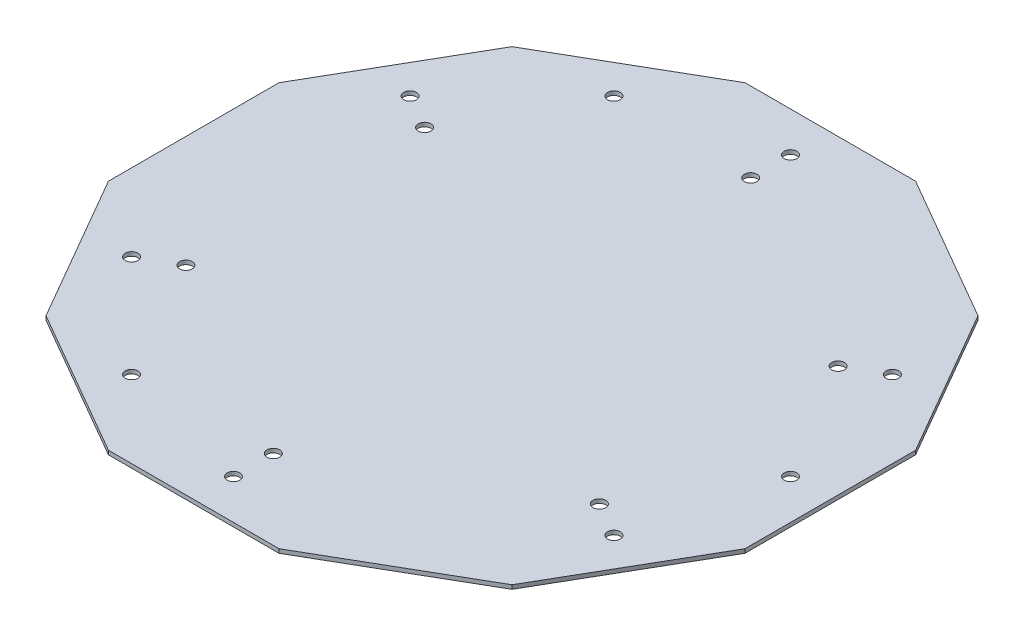
ISO-10303-21;
HEADER;
FILE_DESCRIPTION(('STEP AP214'),'2;1');
FILE_NAME('part.step','',(''),(''),'','','');
FILE_SCHEMA(('AUTOMOTIVE_DESIGN { 1 0 10303 214 1 1 1 1 }'));
ENDSEC;
DATA;
#1=APPLICATION_CONTEXT('core data for automotive mechanical design processes');
#2=APPLICATION_PROTOCOL_DEFINITION('international standard','automotive_design',2000,#1);
#3=PRODUCT_CONTEXT('',#1,'mechanical');
#4=PRODUCT('Part','Part','',(#3));
#5=PRODUCT_RELATED_PRODUCT_CATEGORY('part','',(#4));
#6=PRODUCT_DEFINITION_FORMATION('','',#4);
#7=PRODUCT_DEFINITION_CONTEXT('part definition',#1,'design');
#8=PRODUCT_DEFINITION('design','',#6,#7);
#9=PRODUCT_DEFINITION_SHAPE('','',#8);
#10=(LENGTH_UNIT() NAMED_UNIT(*) SI_UNIT(.MILLI.,.METRE.));
#11=(NAMED_UNIT(*) PLANE_ANGLE_UNIT() SI_UNIT($,.RADIAN.));
#12=(NAMED_UNIT(*) SI_UNIT($,.STERADIAN.) SOLID_ANGLE_UNIT());
#13=UNCERTAINTY_MEASURE_WITH_UNIT(LENGTH_MEASURE(1.E-05),#10,'distance_accuracy_value','');
#14=(GEOMETRIC_REPRESENTATION_CONTEXT(3) GLOBAL_UNCERTAINTY_ASSIGNED_CONTEXT((#13)) GLOBAL_UNIT_ASSIGNED_CONTEXT((#10,
#11,#12)) REPRESENTATION_CONTEXT('',''));
#15=CARTESIAN_POINT('',(0.,0.,0.));
#16=DIRECTION('',(0.,0.,1.));
#17=DIRECTION('',(1.,0.,0.));
#18=AXIS2_PLACEMENT_3D('',#15,#16,#17);
#19=CARTESIAN_POINT('',(79.9999999999999,1.,21.4359353944897));
#20=DIRECTION('',(-1.,0.,0.));
#21=DIRECTION('',(0.,0.,1.));
#22=AXIS2_PLACEMENT_3D('',#19,#20,#21);
#23=PLANE('',#22);
#24=DIRECTION('',(0.,0.,-1.));
#25=VECTOR('',#24,1.);
#26=CARTESIAN_POINT('',(79.9999999999999,0.,21.4359353944897));
#27=LINE('',#26,#25);
#28=CARTESIAN_POINT('',(79.9999999999999,0.,21.4359353944897));
#29=VERTEX_POINT('',#28);
#30=CARTESIAN_POINT('',(79.9999999999999,0.,-21.4359353944899));
#31=VERTEX_POINT('',#30);
#32=EDGE_CURVE('E155',#29,#31,#27,.T.);
#33=ORIENTED_EDGE('',*,*,#32,.T.);
#34=DIRECTION('',(0.,-1.,0.));
#35=VECTOR('',#34,1.);
#36=CARTESIAN_POINT('',(79.9999999999999,1.,-21.4359353944899));
#37=LINE('',#36,#35);
#38=CARTESIAN_POINT('',(79.9999999999999,1.,-21.4359353944899));
#39=VERTEX_POINT('',#38);
#40=EDGE_CURVE('E11',#39,#31,#37,.T.);
#41=ORIENTED_EDGE('',*,*,#40,.F.);
#42=DIRECTION('',(0.,0.,-1.));
#43=VECTOR('',#42,1.);
#44=CARTESIAN_POINT('',(79.9999999999999,1.,21.4359353944897));
#45=LINE('',#44,#43);
#46=CARTESIAN_POINT('',(79.9999999999999,1.,21.4359353944897));
#47=VERTEX_POINT('',#46);
#48=EDGE_CURVE('E178',#47,#39,#45,.T.);
#49=ORIENTED_EDGE('',*,*,#48,.F.);
#50=DIRECTION('',(0.,-1.,0.));
#51=VECTOR('',#50,1.);
#52=CARTESIAN_POINT('',(79.9999999999999,1.,21.4359353944897));
#53=LINE('',#52,#51);
#54=EDGE_CURVE('E151',#47,#29,#53,.T.);
#55=ORIENTED_EDGE('',*,*,#54,.T.);
#56=EDGE_LOOP('',(#33,#41,#49,#55));
#57=FACE_BOUND('',#56,.T.);
#58=ADVANCED_FACE('F35',(#57),#23,.F.);
#59=CARTESIAN_POINT('',(79.9999999999999,1.,-21.4359353944899));
#60=DIRECTION('',(-0.866025403784438,0.,0.500000000000002));
#61=DIRECTION('',(0.500000000000002,0.,0.866025403784438));
#62=AXIS2_PLACEMENT_3D('',#59,#60,#61);
#63=PLANE('',#62);
#64=DIRECTION('',(-0.500000000000002,0.,-0.866025403784438));
#65=VECTOR('',#64,1.);
#66=CARTESIAN_POINT('',(79.9999999999999,0.,-21.4359353944899));
#67=LINE('',#66,#65);
#68=CARTESIAN_POINT('',(58.56406460551,0.,-58.5640646055102));
#69=VERTEX_POINT('',#68);
#70=EDGE_CURVE('E158',#31,#69,#67,.T.);
#71=ORIENTED_EDGE('',*,*,#70,.T.);
#72=DIRECTION('',(0.,-1.,0.));
#73=VECTOR('',#72,1.);
#74=CARTESIAN_POINT('',(58.56406460551,1.,-58.5640646055102));
#75=LINE('',#74,#73);
#76=CARTESIAN_POINT('',(58.56406460551,1.,-58.5640646055102));
#77=VERTEX_POINT('',#76);
#78=EDGE_CURVE('E43',#77,#69,#75,.T.);
#79=ORIENTED_EDGE('',*,*,#78,.F.);
#80=DIRECTION('',(-0.500000000000002,0.,-0.866025403784438));
#81=VECTOR('',#80,1.);
#82=CARTESIAN_POINT('',(79.9999999999999,1.,-21.4359353944899));
#83=LINE('',#82,#81);
#84=EDGE_CURVE('E106',#39,#77,#83,.T.);
#85=ORIENTED_EDGE('',*,*,#84,.F.);
#86=ORIENTED_EDGE('',*,*,#40,.T.);
#87=EDGE_LOOP('',(#71,#79,#85,#86));
#88=FACE_BOUND('',#87,.T.);
#89=ADVANCED_FACE('F257',(#88),#63,.F.);
#90=CARTESIAN_POINT('',(58.56406460551,1.,-58.5640646055102));
#91=DIRECTION('',(-0.499999999999999,0.,0.866025403784439));
#92=DIRECTION('',(0.866025403784439,0.,0.499999999999999));
#93=AXIS2_PLACEMENT_3D('',#90,#91,#92);
#94=PLANE('',#93);
#95=DIRECTION('',(-0.866025403784439,0.,-0.499999999999999));
#96=VECTOR('',#95,1.);
#97=CARTESIAN_POINT('',(58.56406460551,0.,-58.5640646055102));
#98=LINE('',#97,#96);
#99=CARTESIAN_POINT('',(21.4359353944897,0.,-79.9999999999999));
#100=VERTEX_POINT('',#99);
#101=EDGE_CURVE('E161',#69,#100,#98,.T.);
#102=ORIENTED_EDGE('',*,*,#101,.T.);
#103=DIRECTION('',(0.,-1.,0.));
#104=VECTOR('',#103,1.);
#105=CARTESIAN_POINT('',(21.4359353944897,1.,-79.9999999999999));
#106=LINE('',#105,#104);
#107=CARTESIAN_POINT('',(21.4359353944897,1.,-79.9999999999999));
#108=VERTEX_POINT('',#107);
#109=EDGE_CURVE('E197',#108,#100,#106,.T.);
#110=ORIENTED_EDGE('',*,*,#109,.F.);
#111=DIRECTION('',(-0.866025403784439,0.,-0.499999999999999));
#112=VECTOR('',#111,1.);
#113=CARTESIAN_POINT('',(58.56406460551,1.,-58.5640646055102));
#114=LINE('',#113,#112);
#115=EDGE_CURVE('E205',#77,#108,#114,.T.);
#116=ORIENTED_EDGE('',*,*,#115,.F.);
#117=ORIENTED_EDGE('',*,*,#78,.T.);
#118=EDGE_LOOP('',(#102,#110,#116,#117));
#119=FACE_BOUND('',#118,.T.);
#120=ADVANCED_FACE('F203',(#119),#94,.F.);
#121=CARTESIAN_POINT('',(21.4359353944897,1.,-79.9999999999999));
#122=DIRECTION('',(0.,0.,1.));
#123=DIRECTION('',(1.,0.,0.));
#124=AXIS2_PLACEMENT_3D('',#121,#122,#123);
#125=PLANE('',#124);
#126=DIRECTION('',(-1.,0.,0.));
#127=VECTOR('',#126,1.);
#128=CARTESIAN_POINT('',(21.4359353944897,0.,-79.9999999999999));
#129=LINE('',#128,#127);
#130=CARTESIAN_POINT('',(-21.4359353944899,0.,-79.9999999999999));
#131=VERTEX_POINT('',#130);
#132=EDGE_CURVE('E163',#100,#131,#129,.T.);
#133=ORIENTED_EDGE('',*,*,#132,.T.);
#134=DIRECTION('',(0.,-1.,0.));
#135=VECTOR('',#134,1.);
#136=CARTESIAN_POINT('',(-21.4359353944899,1.,-79.9999999999999));
#137=LINE('',#136,#135);
#138=CARTESIAN_POINT('',(-21.4359353944899,1.,-79.9999999999999));
#139=VERTEX_POINT('',#138);
#140=EDGE_CURVE('E194',#139,#131,#137,.T.);
#141=ORIENTED_EDGE('',*,*,#140,.F.);
#142=DIRECTION('',(-1.,0.,0.));
#143=VECTOR('',#142,1.);
#144=CARTESIAN_POINT('',(21.4359353944897,1.,-79.9999999999999));
#145=LINE('',#144,#143);
#146=EDGE_CURVE('E223',#108,#139,#145,.T.);
#147=ORIENTED_EDGE('',*,*,#146,.F.);
#148=ORIENTED_EDGE('',*,*,#109,.T.);
#149=EDGE_LOOP('',(#133,#141,#147,#148));
#150=FACE_BOUND('',#149,.T.);
#151=ADVANCED_FACE('F214',(#150),#125,.F.);
#152=CARTESIAN_POINT('',(-21.4359353944899,1.,-79.9999999999999));
#153=DIRECTION('',(0.500000000000001,0.,0.866025403784438));
#154=DIRECTION('',(0.866025403784438,0.,-0.500000000000001));
#155=AXIS2_PLACEMENT_3D('',#152,#153,#154);
#156=PLANE('',#155);
#157=DIRECTION('',(-0.866025403784438,0.,0.500000000000001));
#158=VECTOR('',#157,1.);
#159=CARTESIAN_POINT('',(-21.4359353944899,0.,-79.9999999999999));
#160=LINE('',#159,#158);
#161=CARTESIAN_POINT('',(-58.5640646055102,0.,-58.56406460551));
#162=VERTEX_POINT('',#161);
#163=EDGE_CURVE('E165',#131,#162,#160,.T.);
#164=ORIENTED_EDGE('',*,*,#163,.T.);
#165=DIRECTION('',(0.,-1.,0.));
#166=VECTOR('',#165,1.);
#167=CARTESIAN_POINT('',(-58.5640646055102,1.,-58.56406460551));
#168=LINE('',#167,#166);
#169=CARTESIAN_POINT('',(-58.5640646055102,1.,-58.56406460551));
#170=VERTEX_POINT('',#169);
#171=EDGE_CURVE('E191',#170,#162,#168,.T.);
#172=ORIENTED_EDGE('',*,*,#171,.F.);
#173=DIRECTION('',(-0.866025403784438,0.,0.500000000000001));
#174=VECTOR('',#173,1.);
#175=CARTESIAN_POINT('',(-21.4359353944899,1.,-79.9999999999999));
#176=LINE('',#175,#174);
#177=EDGE_CURVE('E220',#139,#170,#176,.T.);
#178=ORIENTED_EDGE('',*,*,#177,.F.);
#179=ORIENTED_EDGE('',*,*,#140,.T.);
#180=EDGE_LOOP('',(#164,#172,#178,#179));
#181=FACE_BOUND('',#180,.T.);
#182=ADVANCED_FACE('F218',(#181),#156,.F.);
#183=CARTESIAN_POINT('',(-58.5640646055102,1.,-58.56406460551));
#184=DIRECTION('',(0.866025403784439,0.,0.499999999999999));
#185=DIRECTION('',(0.499999999999999,0.,-0.866025403784439));
#186=AXIS2_PLACEMENT_3D('',#183,#184,#185);
#187=PLANE('',#186);
#188=DIRECTION('',(-0.499999999999999,0.,0.866025403784439));
#189=VECTOR('',#188,1.);
#190=CARTESIAN_POINT('',(-58.5640646055102,0.,-58.56406460551));
#191=LINE('',#190,#189);
#192=CARTESIAN_POINT('',(-79.9999999999999,0.,-21.4359353944897));
#193=VERTEX_POINT('',#192);
#194=EDGE_CURVE('E167',#162,#193,#191,.T.);
#195=ORIENTED_EDGE('',*,*,#194,.T.);
#196=DIRECTION('',(0.,-1.,0.));
#197=VECTOR('',#196,1.);
#198=CARTESIAN_POINT('',(-79.9999999999999,1.,-21.4359353944897));
#199=LINE('',#198,#197);
#200=CARTESIAN_POINT('',(-79.9999999999999,1.,-21.4359353944897));
#201=VERTEX_POINT('',#200);
#202=EDGE_CURVE('E188',#201,#193,#199,.T.);
#203=ORIENTED_EDGE('',*,*,#202,.F.);
#204=DIRECTION('',(-0.499999999999999,0.,0.866025403784439));
#205=VECTOR('',#204,1.);
#206=CARTESIAN_POINT('',(-58.5640646055102,1.,-58.56406460551));
#207=LINE('',#206,#205);
#208=EDGE_CURVE('E222',#170,#201,#207,.T.);
#209=ORIENTED_EDGE('',*,*,#208,.F.);
#210=ORIENTED_EDGE('',*,*,#171,.T.);
#211=EDGE_LOOP('',(#195,#203,#209,#210));
#212=FACE_BOUND('',#211,.T.);
#213=ADVANCED_FACE('F270',(#212),#187,.F.);
#214=CARTESIAN_POINT('',(-79.9999999999999,1.,-21.4359353944897));
#215=DIRECTION('',(1.,0.,0.));
#216=DIRECTION('',(0.,0.,-1.));
#217=AXIS2_PLACEMENT_3D('',#214,#215,#216);
#218=PLANE('',#217);
#219=DIRECTION('',(0.,0.,1.));
#220=VECTOR('',#219,1.);
#221=CARTESIAN_POINT('',(-79.9999999999999,0.,-21.4359353944897));
#222=LINE('',#221,#220);
#223=CARTESIAN_POINT('',(-79.9999999999999,0.,21.4359353944899));
#224=VERTEX_POINT('',#223);
#225=EDGE_CURVE('E169',#193,#224,#222,.T.);
#226=ORIENTED_EDGE('',*,*,#225,.T.);
#227=DIRECTION('',(0.,-1.,0.));
#228=VECTOR('',#227,1.);
#229=CARTESIAN_POINT('',(-79.9999999999999,1.,21.4359353944899));
#230=LINE('',#229,#228);
#231=CARTESIAN_POINT('',(-79.9999999999999,1.,21.4359353944899));
#232=VERTEX_POINT('',#231);
#233=EDGE_CURVE('E185',#232,#224,#230,.T.);
#234=ORIENTED_EDGE('',*,*,#233,.F.);
#235=DIRECTION('',(0.,0.,1.));
#236=VECTOR('',#235,1.);
#237=CARTESIAN_POINT('',(-79.9999999999999,1.,-21.4359353944897));
#238=LINE('',#237,#236);
#239=EDGE_CURVE('E225',#201,#232,#238,.T.);
#240=ORIENTED_EDGE('',*,*,#239,.F.);
#241=ORIENTED_EDGE('',*,*,#202,.T.);
#242=EDGE_LOOP('',(#226,#234,#240,#241));
#243=FACE_BOUND('',#242,.T.);
#244=ADVANCED_FACE('F273',(#243),#218,.F.);
#245=CARTESIAN_POINT('',(-79.9999999999999,1.,21.4359353944899));
#246=DIRECTION('',(0.866025403784438,0.,-0.500000000000001));
#247=DIRECTION('',(-0.500000000000001,0.,-0.866025403784438));
#248=AXIS2_PLACEMENT_3D('',#245,#246,#247);
#249=PLANE('',#248);
#250=DIRECTION('',(0.500000000000001,0.,0.866025403784438));
#251=VECTOR('',#250,1.);
#252=CARTESIAN_POINT('',(-79.9999999999999,0.,21.4359353944899));
#253=LINE('',#252,#251);
#254=CARTESIAN_POINT('',(-58.5640646055101,0.,58.5640646055102));
#255=VERTEX_POINT('',#254);
#256=EDGE_CURVE('E171',#224,#255,#253,.T.);
#257=ORIENTED_EDGE('',*,*,#256,.T.);
#258=DIRECTION('',(0.,-1.,0.));
#259=VECTOR('',#258,1.);
#260=CARTESIAN_POINT('',(-58.5640646055101,1.,58.5640646055102));
#261=LINE('',#260,#259);
#262=CARTESIAN_POINT('',(-58.5640646055101,1.,58.5640646055102));
#263=VERTEX_POINT('',#262);
#264=EDGE_CURVE('E182',#263,#255,#261,.T.);
#265=ORIENTED_EDGE('',*,*,#264,.F.);
#266=DIRECTION('',(0.500000000000001,0.,0.866025403784438));
#267=VECTOR('',#266,1.);
#268=CARTESIAN_POINT('',(-79.9999999999999,1.,21.4359353944899));
#269=LINE('',#268,#267);
#270=EDGE_CURVE('E231',#232,#263,#269,.T.);
#271=ORIENTED_EDGE('',*,*,#270,.F.);
#272=ORIENTED_EDGE('',*,*,#233,.T.);
#273=EDGE_LOOP('',(#257,#265,#271,#272));
#274=FACE_BOUND('',#273,.T.);
#275=ADVANCED_FACE('F237',(#274),#249,.F.);
#276=CARTESIAN_POINT('',(-58.5640646055101,1.,58.5640646055102));
#277=DIRECTION('',(0.499999999999999,0.,-0.866025403784439));
#278=DIRECTION('',(-0.866025403784439,0.,-0.499999999999999));
#279=AXIS2_PLACEMENT_3D('',#276,#277,#278);
#280=PLANE('',#279);
#281=DIRECTION('',(0.866025403784439,0.,0.499999999999999));
#282=VECTOR('',#281,1.);
#283=CARTESIAN_POINT('',(-58.5640646055101,0.,58.5640646055102));
#284=LINE('',#283,#282);
#285=CARTESIAN_POINT('',(-21.4359353944897,0.,79.9999999999999));
#286=VERTEX_POINT('',#285);
#287=EDGE_CURVE('E173',#255,#286,#284,.T.);
#288=ORIENTED_EDGE('',*,*,#287,.T.);
#289=DIRECTION('',(0.,-1.,0.));
#290=VECTOR('',#289,1.);
#291=CARTESIAN_POINT('',(-21.4359353944897,1.,79.9999999999999));
#292=LINE('',#291,#290);
#293=CARTESIAN_POINT('',(-21.4359353944897,1.,79.9999999999999));
#294=VERTEX_POINT('',#293);
#295=EDGE_CURVE('E146',#294,#286,#292,.T.);
#296=ORIENTED_EDGE('',*,*,#295,.F.);
#297=DIRECTION('',(0.866025403784439,0.,0.499999999999999));
#298=VECTOR('',#297,1.);
#299=CARTESIAN_POINT('',(-58.5640646055101,1.,58.5640646055102));
#300=LINE('',#299,#298);
#301=EDGE_CURVE('E137',#263,#294,#300,.T.);
#302=ORIENTED_EDGE('',*,*,#301,.F.);
#303=ORIENTED_EDGE('',*,*,#264,.T.);
#304=EDGE_LOOP('',(#288,#296,#302,#303));
#305=FACE_BOUND('',#304,.T.);
#306=ADVANCED_FACE('F241',(#305),#280,.F.);
#307=CARTESIAN_POINT('',(-21.4359353944897,1.,79.9999999999999));
#308=DIRECTION('',(0.,0.,-1.));
#309=DIRECTION('',(-1.,0.,0.));
#310=AXIS2_PLACEMENT_3D('',#307,#308,#309);
#311=PLANE('',#310);
#312=DIRECTION('',(1.,0.,0.));
#313=VECTOR('',#312,1.);
#314=CARTESIAN_POINT('',(-21.4359353944897,0.,79.9999999999999));
#315=LINE('',#314,#313);
#316=CARTESIAN_POINT('',(21.4359353944899,0.,79.9999999999999));
#317=VERTEX_POINT('',#316);
#318=EDGE_CURVE('E145',#286,#317,#315,.T.);
#319=ORIENTED_EDGE('',*,*,#318,.T.);
#320=DIRECTION('',(0.,-1.,0.));
#321=VECTOR('',#320,1.);
#322=CARTESIAN_POINT('',(21.4359353944899,1.,79.9999999999999));
#323=LINE('',#322,#321);
#324=CARTESIAN_POINT('',(21.4359353944899,1.,79.9999999999999));
#325=VERTEX_POINT('',#324);
#326=EDGE_CURVE('E142',#325,#317,#323,.T.);
#327=ORIENTED_EDGE('',*,*,#326,.F.);
#328=DIRECTION('',(1.,0.,0.));
#329=VECTOR('',#328,1.);
#330=CARTESIAN_POINT('',(-21.4359353944897,1.,79.9999999999999));
#331=LINE('',#330,#329);
#332=EDGE_CURVE('E131',#294,#325,#331,.T.);
#333=ORIENTED_EDGE('',*,*,#332,.F.);
#334=ORIENTED_EDGE('',*,*,#295,.T.);
#335=EDGE_LOOP('',(#319,#327,#333,#334));
#336=FACE_BOUND('',#335,.T.);
#337=ADVANCED_FACE('F143',(#336),#311,.F.);
#338=CARTESIAN_POINT('',(21.4359353944899,1.,79.9999999999999));
#339=DIRECTION('',(-0.500000000000001,0.,-0.866025403784438));
#340=DIRECTION('',(-0.866025403784438,0.,0.500000000000001));
#341=AXIS2_PLACEMENT_3D('',#338,#339,#340);
#342=PLANE('',#341);
#343=DIRECTION('',(0.866025403784438,0.,-0.500000000000001));
#344=VECTOR('',#343,1.);
#345=CARTESIAN_POINT('',(21.4359353944899,0.,79.9999999999999));
#346=LINE('',#345,#344);
#347=CARTESIAN_POINT('',(58.5640646055102,0.,58.5640646055101));
#348=VERTEX_POINT('',#347);
#349=EDGE_CURVE('E92',#317,#348,#346,.T.);
#350=ORIENTED_EDGE('',*,*,#349,.T.);
#351=DIRECTION('',(0.,-1.,0.));
#352=VECTOR('',#351,1.);
#353=CARTESIAN_POINT('',(58.5640646055102,1.,58.5640646055101));
#354=LINE('',#353,#352);
#355=CARTESIAN_POINT('',(58.5640646055102,1.,58.5640646055101));
#356=VERTEX_POINT('',#355);
#357=EDGE_CURVE('E147',#356,#348,#354,.T.);
#358=ORIENTED_EDGE('',*,*,#357,.F.);
#359=DIRECTION('',(0.866025403784438,0.,-0.500000000000001));
#360=VECTOR('',#359,1.);
#361=CARTESIAN_POINT('',(21.4359353944899,1.,79.9999999999999));
#362=LINE('',#361,#360);
#363=EDGE_CURVE('E135',#325,#356,#362,.T.);
#364=ORIENTED_EDGE('',*,*,#363,.F.);
#365=ORIENTED_EDGE('',*,*,#326,.T.);
#366=EDGE_LOOP('',(#350,#358,#364,#365));
#367=FACE_BOUND('',#366,.T.);
#368=ADVANCED_FACE('F149',(#367),#342,.F.);
#369=CARTESIAN_POINT('',(58.5640646055102,1.,58.5640646055101));
#370=DIRECTION('',(-0.866025403784439,0.,-0.499999999999999));
#371=DIRECTION('',(-0.499999999999999,0.,0.866025403784439));
#372=AXIS2_PLACEMENT_3D('',#369,#370,#371);
#373=PLANE('',#372);
#374=DIRECTION('',(0.499999999999999,0.,-0.866025403784439));
#375=VECTOR('',#374,1.);
#376=CARTESIAN_POINT('',(58.5640646055102,0.,58.5640646055101));
#377=LINE('',#376,#375);
#378=EDGE_CURVE('E98',#348,#29,#377,.T.);
#379=ORIENTED_EDGE('',*,*,#378,.T.);
#380=ORIENTED_EDGE('',*,*,#54,.F.);
#381=DIRECTION('',(0.499999999999999,0.,-0.866025403784439));
#382=VECTOR('',#381,1.);
#383=CARTESIAN_POINT('',(58.5640646055102,1.,58.5640646055101));
#384=LINE('',#383,#382);
#385=EDGE_CURVE('E51',#356,#47,#384,.T.);
#386=ORIENTED_EDGE('',*,*,#385,.F.);
#387=ORIENTED_EDGE('',*,*,#357,.T.);
#388=EDGE_LOOP('',(#379,#380,#386,#387));
#389=FACE_BOUND('',#388,.T.);
#390=ADVANCED_FACE('F245',(#389),#373,.F.);
#391=CARTESIAN_POINT('',(0.,1.,0.));
#392=DIRECTION('',(0.,1.,0.));
#393=DIRECTION('',(0.,0.,1.));
#394=AXIS2_PLACEMENT_3D('',#391,#392,#393);
#395=PLANE('',#394);
#396=CARTESIAN_POINT('',(70.,1.,2.4980018054066E-13));
#397=DIRECTION('',(0.,1.,0.));
#398=DIRECTION('',(0.,0.,1.));
#399=AXIS2_PLACEMENT_3D('',#396,#397,#398);
#400=CIRCLE('',#399,1.6);
#401=CARTESIAN_POINT('',(70.,1.,1.60000000000025));
#402=VERTEX_POINT('',#401);
#403=EDGE_CURVE('E466',#402,#402,#400,.T.);
#404=ORIENTED_EDGE('',*,*,#403,.F.);
#405=EDGE_LOOP('',(#404));
#406=FACE_BOUND('',#405,.T.);
#407=CARTESIAN_POINT('',(-34.9999999999997,1.,60.6217782649109));
#408=DIRECTION('',(0.,1.,0.));
#409=DIRECTION('',(0.,0.,1.));
#410=AXIS2_PLACEMENT_3D('',#407,#408,#409);
#411=CIRCLE('',#410,1.60000000000001);
#412=CARTESIAN_POINT('',(-34.9999999999997,1.,62.2217782649109));
#413=VERTEX_POINT('',#412);
#414=EDGE_CURVE('E470',#413,#413,#411,.T.);
#415=ORIENTED_EDGE('',*,*,#414,.F.);
#416=EDGE_LOOP('',(#415));
#417=FACE_BOUND('',#416,.T.);
#418=CARTESIAN_POINT('',(-35.0000000000001,1.,-60.6217782649107));
#419=DIRECTION('',(0.,1.,0.));
#420=DIRECTION('',(0.,0.,1.));
#421=AXIS2_PLACEMENT_3D('',#418,#419,#420);
#422=CIRCLE('',#421,1.60000000000001);
#423=CARTESIAN_POINT('',(-35.0000000000001,1.,-59.0217782649107));
#424=VERTEX_POINT('',#423);
#425=EDGE_CURVE('E479',#424,#424,#422,.T.);
#426=ORIENTED_EDGE('',*,*,#425,.F.);
#427=EDGE_LOOP('',(#426));
#428=FACE_BOUND('',#427,.T.);
#429=CARTESIAN_POINT('',(0.,1.,60.));
#430=DIRECTION('',(0.,1.,0.));
#431=DIRECTION('',(0.,0.,1.));
#432=AXIS2_PLACEMENT_3D('',#429,#430,#431);
#433=CIRCLE('',#432,1.6);
#434=CARTESIAN_POINT('',(0.,1.,61.6));
#435=VERTEX_POINT('',#434);
#436=EDGE_CURVE('E485',#435,#435,#433,.T.);
#437=ORIENTED_EDGE('',*,*,#436,.F.);
#438=EDGE_LOOP('',(#437));
#439=FACE_BOUND('',#438,.T.);
#440=CARTESIAN_POINT('',(0.,1.,70.));
#441=DIRECTION('',(0.,1.,0.));
#442=DIRECTION('',(0.,0.,1.));
#443=AXIS2_PLACEMENT_3D('',#440,#441,#442);
#444=CIRCLE('',#443,1.6);
#445=CARTESIAN_POINT('',(0.,1.,71.6));
#446=VERTEX_POINT('',#445);
#447=EDGE_CURVE('E489',#446,#446,#444,.T.);
#448=ORIENTED_EDGE('',*,*,#447,.F.);
#449=EDGE_LOOP('',(#448));
#450=FACE_BOUND('',#449,.T.);
#451=CARTESIAN_POINT('',(0.,1.,-60.));
#452=DIRECTION('',(0.,1.,0.));
#453=DIRECTION('',(0.,0.,1.));
#454=AXIS2_PLACEMENT_3D('',#451,#452,#453);
#455=CIRCLE('',#454,1.6);
#456=CARTESIAN_POINT('',(0.,1.,-58.4));
#457=VERTEX_POINT('',#456);
#458=EDGE_CURVE('E495',#457,#457,#455,.T.);
#459=ORIENTED_EDGE('',*,*,#458,.F.);
#460=EDGE_LOOP('',(#459));
#461=FACE_BOUND('',#460,.T.);
#462=CARTESIAN_POINT('',(0.,1.,-70.));
#463=DIRECTION('',(0.,1.,0.));
#464=DIRECTION('',(0.,0.,1.));
#465=AXIS2_PLACEMENT_3D('',#462,#463,#464);
#466=CIRCLE('',#465,1.6);
#467=CARTESIAN_POINT('',(0.,1.,-68.4));
#468=VERTEX_POINT('',#467);
#469=EDGE_CURVE('E501',#468,#468,#466,.T.);
#470=ORIENTED_EDGE('',*,*,#469,.F.);
#471=EDGE_LOOP('',(#470));
#472=FACE_BOUND('',#471,.T.);
#473=CARTESIAN_POINT('',(-51.9615242270664,1.,29.9999999999999));
#474=DIRECTION('',(0.,1.,0.));
#475=DIRECTION('',(0.,0.,1.));
#476=AXIS2_PLACEMENT_3D('',#473,#474,#475);
#477=CIRCLE('',#476,1.6);
#478=CARTESIAN_POINT('',(-51.9615242270664,1.,31.5999999999999));
#479=VERTEX_POINT('',#478);
#480=EDGE_CURVE('E507',#479,#479,#477,.T.);
#481=ORIENTED_EDGE('',*,*,#480,.F.);
#482=EDGE_LOOP('',(#481));
#483=FACE_BOUND('',#482,.T.);
#484=CARTESIAN_POINT('',(-60.6217782649108,1.,34.9999999999999));
#485=DIRECTION('',(0.,1.,0.));
#486=DIRECTION('',(0.,0.,1.));
#487=AXIS2_PLACEMENT_3D('',#484,#485,#486);
#488=CIRCLE('',#487,1.60000000000001);
#489=CARTESIAN_POINT('',(-60.6217782649108,1.,36.5999999999999));
#490=VERTEX_POINT('',#489);
#491=EDGE_CURVE('E513',#490,#490,#488,.T.);
#492=ORIENTED_EDGE('',*,*,#491,.F.);
#493=EDGE_LOOP('',(#492));
#494=FACE_BOUND('',#493,.T.);
#495=CARTESIAN_POINT('',(51.9615242270664,1.,-29.9999999999999));
#496=DIRECTION('',(0.,1.,0.));
#497=DIRECTION('',(0.,0.,1.));
#498=AXIS2_PLACEMENT_3D('',#495,#496,#497);
#499=CIRCLE('',#498,1.6);
#500=CARTESIAN_POINT('',(51.9615242270664,1.,-28.3999999999999));
#501=VERTEX_POINT('',#500);
#502=EDGE_CURVE('E519',#501,#501,#499,.T.);
#503=ORIENTED_EDGE('',*,*,#502,.F.);
#504=EDGE_LOOP('',(#503));
#505=FACE_BOUND('',#504,.T.);
#506=CARTESIAN_POINT('',(60.6217782649108,1.,-34.9999999999999));
#507=DIRECTION('',(0.,1.,0.));
#508=DIRECTION('',(0.,0.,1.));
#509=AXIS2_PLACEMENT_3D('',#506,#507,#508);
#510=CIRCLE('',#509,1.6);
#511=CARTESIAN_POINT('',(60.6217782649108,1.,-33.3999999999999));
#512=VERTEX_POINT('',#511);
#513=EDGE_CURVE('E525',#512,#512,#510,.T.);
#514=ORIENTED_EDGE('',*,*,#513,.F.);
#515=EDGE_LOOP('',(#514));
#516=FACE_BOUND('',#515,.T.);
#517=CARTESIAN_POINT('',(51.9615242270664,1.,29.9999999999999));
#518=DIRECTION('',(0.,1.,0.));
#519=DIRECTION('',(0.,0.,1.));
#520=AXIS2_PLACEMENT_3D('',#517,#518,#519);
#521=CIRCLE('',#520,1.6);
#522=CARTESIAN_POINT('',(51.9615242270664,1.,31.5999999999999));
#523=VERTEX_POINT('',#522);
#524=EDGE_CURVE('E531',#523,#523,#521,.T.);
#525=ORIENTED_EDGE('',*,*,#524,.F.);
#526=EDGE_LOOP('',(#525));
#527=FACE_BOUND('',#526,.T.);
#528=CARTESIAN_POINT('',(60.6217782649108,1.,34.9999999999999));
#529=DIRECTION('',(0.,1.,0.));
#530=DIRECTION('',(0.,0.,1.));
#531=AXIS2_PLACEMENT_3D('',#528,#529,#530);
#532=CIRCLE('',#531,1.6);
#533=CARTESIAN_POINT('',(60.6217782649108,1.,36.5999999999999));
#534=VERTEX_POINT('',#533);
#535=EDGE_CURVE('E537',#534,#534,#532,.T.);
#536=ORIENTED_EDGE('',*,*,#535,.F.);
#537=EDGE_LOOP('',(#536));
#538=FACE_BOUND('',#537,.T.);
#539=CARTESIAN_POINT('',(-51.9615242270665,1.,-30.));
#540=DIRECTION('',(0.,1.,0.));
#541=DIRECTION('',(0.,0.,1.));
#542=AXIS2_PLACEMENT_3D('',#539,#540,#541);
#543=CIRCLE('',#542,1.59999999999999);
#544=CARTESIAN_POINT('',(-51.9615242270665,1.,-28.4));
#545=VERTEX_POINT('',#544);
#546=EDGE_CURVE('E543',#545,#545,#543,.T.);
#547=ORIENTED_EDGE('',*,*,#546,.F.);
#548=EDGE_LOOP('',(#547));
#549=FACE_BOUND('',#548,.T.);
#550=CARTESIAN_POINT('',(-60.6217782649108,1.,-34.9999999999999));
#551=DIRECTION('',(0.,1.,0.));
#552=DIRECTION('',(0.,0.,1.));
#553=AXIS2_PLACEMENT_3D('',#550,#551,#552);
#554=CIRCLE('',#553,1.6);
#555=CARTESIAN_POINT('',(-60.6217782649108,1.,-33.3999999999999));
#556=VERTEX_POINT('',#555);
#557=EDGE_CURVE('E549',#556,#556,#554,.T.);
#558=ORIENTED_EDGE('',*,*,#557,.F.);
#559=EDGE_LOOP('',(#558));
#560=FACE_BOUND('',#559,.T.);
#561=ORIENTED_EDGE('',*,*,#48,.T.);
#562=ORIENTED_EDGE('',*,*,#84,.T.);
#563=ORIENTED_EDGE('',*,*,#115,.T.);
#564=ORIENTED_EDGE('',*,*,#146,.T.);
#565=ORIENTED_EDGE('',*,*,#177,.T.);
#566=ORIENTED_EDGE('',*,*,#208,.T.);
#567=ORIENTED_EDGE('',*,*,#239,.T.);
#568=ORIENTED_EDGE('',*,*,#270,.T.);
#569=ORIENTED_EDGE('',*,*,#301,.T.);
#570=ORIENTED_EDGE('',*,*,#332,.T.);
#571=ORIENTED_EDGE('',*,*,#363,.T.);
#572=ORIENTED_EDGE('',*,*,#385,.T.);
#573=EDGE_LOOP('',(#561,#562,#563,#564,#565,#566,#567,#568,#569,#570,#571,#572));
#574=FACE_BOUND('',#573,.T.);
#575=ADVANCED_FACE('F133',(#406,#417,#428,#439,#450,#461,#472,#483,#494,#505,#516,#527,#538,
#549,#560,#574),#395,.T.);
#576=CARTESIAN_POINT('',(0.,0.,0.));
#577=DIRECTION('',(0.,1.,0.));
#578=DIRECTION('',(0.,0.,1.));
#579=AXIS2_PLACEMENT_3D('',#576,#577,#578);
#580=PLANE('',#579);
#581=CARTESIAN_POINT('',(70.,0.,2.4980018054066E-13));
#582=DIRECTION('',(0.,1.,0.));
#583=DIRECTION('',(0.,0.,1.));
#584=AXIS2_PLACEMENT_3D('',#581,#582,#583);
#585=CIRCLE('',#584,1.6);
#586=CARTESIAN_POINT('',(70.,0.,1.60000000000025));
#587=VERTEX_POINT('',#586);
#588=EDGE_CURVE('E469',#587,#587,#585,.F.);
#589=ORIENTED_EDGE('',*,*,#588,.F.);
#590=EDGE_LOOP('',(#589));
#591=FACE_BOUND('',#590,.T.);
#592=CARTESIAN_POINT('',(-34.9999999999997,0.,60.6217782649109));
#593=DIRECTION('',(0.,1.,0.));
#594=DIRECTION('',(0.,0.,1.));
#595=AXIS2_PLACEMENT_3D('',#592,#593,#594);
#596=CIRCLE('',#595,1.60000000000001);
#597=CARTESIAN_POINT('',(-34.9999999999997,0.,62.2217782649109));
#598=VERTEX_POINT('',#597);
#599=EDGE_CURVE('E473',#598,#598,#596,.F.);
#600=ORIENTED_EDGE('',*,*,#599,.F.);
#601=EDGE_LOOP('',(#600));
#602=FACE_BOUND('',#601,.T.);
#603=CARTESIAN_POINT('',(-35.0000000000001,0.,-60.6217782649107));
#604=DIRECTION('',(0.,1.,0.));
#605=DIRECTION('',(0.,0.,1.));
#606=AXIS2_PLACEMENT_3D('',#603,#604,#605);
#607=CIRCLE('',#606,1.60000000000001);
#608=CARTESIAN_POINT('',(-35.0000000000001,0.,-59.0217782649107));
#609=VERTEX_POINT('',#608);
#610=EDGE_CURVE('E482',#609,#609,#607,.F.);
#611=ORIENTED_EDGE('',*,*,#610,.F.);
#612=EDGE_LOOP('',(#611));
#613=FACE_BOUND('',#612,.T.);
#614=CARTESIAN_POINT('',(0.,0.,60.));
#615=DIRECTION('',(0.,1.,0.));
#616=DIRECTION('',(0.,0.,1.));
#617=AXIS2_PLACEMENT_3D('',#614,#615,#616);
#618=CIRCLE('',#617,1.6);
#619=CARTESIAN_POINT('',(0.,0.,61.6));
#620=VERTEX_POINT('',#619);
#621=EDGE_CURVE('E486',#620,#620,#618,.T.);
#622=ORIENTED_EDGE('',*,*,#621,.T.);
#623=EDGE_LOOP('',(#622));
#624=FACE_BOUND('',#623,.T.);
#625=CARTESIAN_POINT('',(0.,0.,70.));
#626=DIRECTION('',(0.,1.,0.));
#627=DIRECTION('',(0.,0.,1.));
#628=AXIS2_PLACEMENT_3D('',#625,#626,#627);
#629=CIRCLE('',#628,1.6);
#630=CARTESIAN_POINT('',(0.,0.,71.6));
#631=VERTEX_POINT('',#630);
#632=EDGE_CURVE('E492',#631,#631,#629,.T.);
#633=ORIENTED_EDGE('',*,*,#632,.T.);
#634=EDGE_LOOP('',(#633));
#635=FACE_BOUND('',#634,.T.);
#636=CARTESIAN_POINT('',(0.,0.,-60.));
#637=DIRECTION('',(0.,1.,0.));
#638=DIRECTION('',(0.,0.,1.));
#639=AXIS2_PLACEMENT_3D('',#636,#637,#638);
#640=CIRCLE('',#639,1.6);
#641=CARTESIAN_POINT('',(0.,0.,-58.4));
#642=VERTEX_POINT('',#641);
#643=EDGE_CURVE('E498',#642,#642,#640,.T.);
#644=ORIENTED_EDGE('',*,*,#643,.T.);
#645=EDGE_LOOP('',(#644));
#646=FACE_BOUND('',#645,.T.);
#647=CARTESIAN_POINT('',(0.,0.,-70.));
#648=DIRECTION('',(0.,1.,0.));
#649=DIRECTION('',(0.,0.,1.));
#650=AXIS2_PLACEMENT_3D('',#647,#648,#649);
#651=CIRCLE('',#650,1.6);
#652=CARTESIAN_POINT('',(0.,0.,-68.4));
#653=VERTEX_POINT('',#652);
#654=EDGE_CURVE('E504',#653,#653,#651,.T.);
#655=ORIENTED_EDGE('',*,*,#654,.T.);
#656=EDGE_LOOP('',(#655));
#657=FACE_BOUND('',#656,.T.);
#658=CARTESIAN_POINT('',(-51.9615242270664,0.,29.9999999999999));
#659=DIRECTION('',(0.,1.,0.));
#660=DIRECTION('',(0.,0.,1.));
#661=AXIS2_PLACEMENT_3D('',#658,#659,#660);
#662=CIRCLE('',#661,1.6);
#663=CARTESIAN_POINT('',(-51.9615242270664,0.,31.5999999999999));
#664=VERTEX_POINT('',#663);
#665=EDGE_CURVE('E510',#664,#664,#662,.T.);
#666=ORIENTED_EDGE('',*,*,#665,.T.);
#667=EDGE_LOOP('',(#666));
#668=FACE_BOUND('',#667,.T.);
#669=CARTESIAN_POINT('',(-60.6217782649108,0.,34.9999999999999));
#670=DIRECTION('',(0.,1.,0.));
#671=DIRECTION('',(0.,0.,1.));
#672=AXIS2_PLACEMENT_3D('',#669,#670,#671);
#673=CIRCLE('',#672,1.60000000000001);
#674=CARTESIAN_POINT('',(-60.6217782649108,0.,36.5999999999999));
#675=VERTEX_POINT('',#674);
#676=EDGE_CURVE('E516',#675,#675,#673,.T.);
#677=ORIENTED_EDGE('',*,*,#676,.T.);
#678=EDGE_LOOP('',(#677));
#679=FACE_BOUND('',#678,.T.);
#680=CARTESIAN_POINT('',(51.9615242270664,0.,-29.9999999999999));
#681=DIRECTION('',(0.,1.,0.));
#682=DIRECTION('',(0.,0.,1.));
#683=AXIS2_PLACEMENT_3D('',#680,#681,#682);
#684=CIRCLE('',#683,1.6);
#685=CARTESIAN_POINT('',(51.9615242270664,0.,-28.3999999999999));
#686=VERTEX_POINT('',#685);
#687=EDGE_CURVE('E522',#686,#686,#684,.T.);
#688=ORIENTED_EDGE('',*,*,#687,.T.);
#689=EDGE_LOOP('',(#688));
#690=FACE_BOUND('',#689,.T.);
#691=CARTESIAN_POINT('',(60.6217782649108,0.,-34.9999999999999));
#692=DIRECTION('',(0.,1.,0.));
#693=DIRECTION('',(0.,0.,1.));
#694=AXIS2_PLACEMENT_3D('',#691,#692,#693);
#695=CIRCLE('',#694,1.6);
#696=CARTESIAN_POINT('',(60.6217782649108,0.,-33.3999999999999));
#697=VERTEX_POINT('',#696);
#698=EDGE_CURVE('E528',#697,#697,#695,.T.);
#699=ORIENTED_EDGE('',*,*,#698,.T.);
#700=EDGE_LOOP('',(#699));
#701=FACE_BOUND('',#700,.T.);
#702=CARTESIAN_POINT('',(51.9615242270664,0.,29.9999999999999));
#703=DIRECTION('',(0.,1.,0.));
#704=DIRECTION('',(0.,0.,1.));
#705=AXIS2_PLACEMENT_3D('',#702,#703,#704);
#706=CIRCLE('',#705,1.6);
#707=CARTESIAN_POINT('',(51.9615242270664,0.,31.5999999999999));
#708=VERTEX_POINT('',#707);
#709=EDGE_CURVE('E534',#708,#708,#706,.T.);
#710=ORIENTED_EDGE('',*,*,#709,.T.);
#711=EDGE_LOOP('',(#710));
#712=FACE_BOUND('',#711,.T.);
#713=CARTESIAN_POINT('',(60.6217782649108,0.,34.9999999999999));
#714=DIRECTION('',(0.,1.,0.));
#715=DIRECTION('',(0.,0.,1.));
#716=AXIS2_PLACEMENT_3D('',#713,#714,#715);
#717=CIRCLE('',#716,1.6);
#718=CARTESIAN_POINT('',(60.6217782649108,0.,36.5999999999999));
#719=VERTEX_POINT('',#718);
#720=EDGE_CURVE('E540',#719,#719,#717,.T.);
#721=ORIENTED_EDGE('',*,*,#720,.T.);
#722=EDGE_LOOP('',(#721));
#723=FACE_BOUND('',#722,.T.);
#724=CARTESIAN_POINT('',(-51.9615242270665,0.,-30.));
#725=DIRECTION('',(0.,1.,0.));
#726=DIRECTION('',(0.,0.,1.));
#727=AXIS2_PLACEMENT_3D('',#724,#725,#726);
#728=CIRCLE('',#727,1.59999999999999);
#729=CARTESIAN_POINT('',(-51.9615242270665,0.,-28.4));
#730=VERTEX_POINT('',#729);
#731=EDGE_CURVE('E546',#730,#730,#728,.T.);
#732=ORIENTED_EDGE('',*,*,#731,.T.);
#733=EDGE_LOOP('',(#732));
#734=FACE_BOUND('',#733,.T.);
#735=CARTESIAN_POINT('',(-60.6217782649108,0.,-34.9999999999999));
#736=DIRECTION('',(0.,1.,0.));
#737=DIRECTION('',(0.,0.,1.));
#738=AXIS2_PLACEMENT_3D('',#735,#736,#737);
#739=CIRCLE('',#738,1.6);
#740=CARTESIAN_POINT('',(-60.6217782649108,0.,-33.3999999999999));
#741=VERTEX_POINT('',#740);
#742=EDGE_CURVE('E159',#741,#741,#739,.T.);
#743=ORIENTED_EDGE('',*,*,#742,.T.);
#744=EDGE_LOOP('',(#743));
#745=FACE_BOUND('',#744,.T.);
#746=ORIENTED_EDGE('',*,*,#32,.F.);
#747=ORIENTED_EDGE('',*,*,#378,.F.);
#748=ORIENTED_EDGE('',*,*,#349,.F.);
#749=ORIENTED_EDGE('',*,*,#318,.F.);
#750=ORIENTED_EDGE('',*,*,#287,.F.);
#751=ORIENTED_EDGE('',*,*,#256,.F.);
#752=ORIENTED_EDGE('',*,*,#225,.F.);
#753=ORIENTED_EDGE('',*,*,#194,.F.);
#754=ORIENTED_EDGE('',*,*,#163,.F.);
#755=ORIENTED_EDGE('',*,*,#132,.F.);
#756=ORIENTED_EDGE('',*,*,#101,.F.);
#757=ORIENTED_EDGE('',*,*,#70,.F.);
#758=EDGE_LOOP('',(#746,#747,#748,#749,#750,#751,#752,#753,#754,#755,#756,#757));
#759=FACE_BOUND('',#758,.T.);
#760=ADVANCED_FACE('F209',(#591,#602,#613,#624,#635,#646,#657,#668,#679,#690,#701,#712,#723,
#734,#745,#759),#580,.F.);
#761=CARTESIAN_POINT('',(-60.6217782649108,0.,-34.9999999999999));
#762=DIRECTION('',(0.,1.,0.));
#763=DIRECTION('',(0.,0.,1.));
#764=AXIS2_PLACEMENT_3D('',#761,#762,#763);
#765=CYLINDRICAL_SURFACE('',#764,1.6);
#766=ORIENTED_EDGE('',*,*,#742,.F.);
#767=EDGE_LOOP('',(#766));
#768=FACE_BOUND('',#767,.T.);
#769=ORIENTED_EDGE('',*,*,#557,.T.);
#770=EDGE_LOOP('',(#769));
#771=FACE_BOUND('',#770,.T.);
#772=ADVANCED_FACE('F301',(#768,#771),#765,.F.);
#773=CARTESIAN_POINT('',(-51.9615242270665,0.,-30.));
#774=DIRECTION('',(0.,1.,0.));
#775=DIRECTION('',(0.,0.,1.));
#776=AXIS2_PLACEMENT_3D('',#773,#774,#775);
#777=CYLINDRICAL_SURFACE('',#776,1.59999999999999);
#778=ORIENTED_EDGE('',*,*,#731,.F.);
#779=EDGE_LOOP('',(#778));
#780=FACE_BOUND('',#779,.T.);
#781=ORIENTED_EDGE('',*,*,#546,.T.);
#782=EDGE_LOOP('',(#781));
#783=FACE_BOUND('',#782,.T.);
#784=ADVANCED_FACE('F306',(#780,#783),#777,.F.);
#785=CARTESIAN_POINT('',(60.6217782649108,0.,34.9999999999999));
#786=DIRECTION('',(0.,1.,0.));
#787=DIRECTION('',(0.,0.,1.));
#788=AXIS2_PLACEMENT_3D('',#785,#786,#787);
#789=CYLINDRICAL_SURFACE('',#788,1.6);
#790=ORIENTED_EDGE('',*,*,#720,.F.);
#791=EDGE_LOOP('',(#790));
#792=FACE_BOUND('',#791,.T.);
#793=ORIENTED_EDGE('',*,*,#535,.T.);
#794=EDGE_LOOP('',(#793));
#795=FACE_BOUND('',#794,.T.);
#796=ADVANCED_FACE('F318',(#792,#795),#789,.F.);
#797=CARTESIAN_POINT('',(51.9615242270664,0.,29.9999999999999));
#798=DIRECTION('',(0.,1.,0.));
#799=DIRECTION('',(0.,0.,1.));
#800=AXIS2_PLACEMENT_3D('',#797,#798,#799);
#801=CYLINDRICAL_SURFACE('',#800,1.6);
#802=ORIENTED_EDGE('',*,*,#709,.F.);
#803=EDGE_LOOP('',(#802));
#804=FACE_BOUND('',#803,.T.);
#805=ORIENTED_EDGE('',*,*,#524,.T.);
#806=EDGE_LOOP('',(#805));
#807=FACE_BOUND('',#806,.T.);
#808=ADVANCED_FACE('F328',(#804,#807),#801,.F.);
#809=CARTESIAN_POINT('',(60.6217782649108,0.,-34.9999999999999));
#810=DIRECTION('',(0.,1.,0.));
#811=DIRECTION('',(0.,0.,1.));
#812=AXIS2_PLACEMENT_3D('',#809,#810,#811);
#813=CYLINDRICAL_SURFACE('',#812,1.6);
#814=ORIENTED_EDGE('',*,*,#698,.F.);
#815=EDGE_LOOP('',(#814));
#816=FACE_BOUND('',#815,.T.);
#817=ORIENTED_EDGE('',*,*,#513,.T.);
#818=EDGE_LOOP('',(#817));
#819=FACE_BOUND('',#818,.T.);
#820=ADVANCED_FACE('F338',(#816,#819),#813,.F.);
#821=CARTESIAN_POINT('',(51.9615242270664,0.,-29.9999999999999));
#822=DIRECTION('',(0.,1.,0.));
#823=DIRECTION('',(0.,0.,1.));
#824=AXIS2_PLACEMENT_3D('',#821,#822,#823);
#825=CYLINDRICAL_SURFACE('',#824,1.6);
#826=ORIENTED_EDGE('',*,*,#687,.F.);
#827=EDGE_LOOP('',(#826));
#828=FACE_BOUND('',#827,.T.);
#829=ORIENTED_EDGE('',*,*,#502,.T.);
#830=EDGE_LOOP('',(#829));
#831=FACE_BOUND('',#830,.T.);
#832=ADVANCED_FACE('F348',(#828,#831),#825,.F.);
#833=CARTESIAN_POINT('',(-60.6217782649108,0.,34.9999999999999));
#834=DIRECTION('',(0.,1.,0.));
#835=DIRECTION('',(0.,0.,1.));
#836=AXIS2_PLACEMENT_3D('',#833,#834,#835);
#837=CYLINDRICAL_SURFACE('',#836,1.60000000000001);
#838=ORIENTED_EDGE('',*,*,#676,.F.);
#839=EDGE_LOOP('',(#838));
#840=FACE_BOUND('',#839,.T.);
#841=ORIENTED_EDGE('',*,*,#491,.T.);
#842=EDGE_LOOP('',(#841));
#843=FACE_BOUND('',#842,.T.);
#844=ADVANCED_FACE('F358',(#840,#843),#837,.F.);
#845=CARTESIAN_POINT('',(-51.9615242270664,0.,29.9999999999999));
#846=DIRECTION('',(0.,1.,0.));
#847=DIRECTION('',(0.,0.,1.));
#848=AXIS2_PLACEMENT_3D('',#845,#846,#847);
#849=CYLINDRICAL_SURFACE('',#848,1.6);
#850=ORIENTED_EDGE('',*,*,#665,.F.);
#851=EDGE_LOOP('',(#850));
#852=FACE_BOUND('',#851,.T.);
#853=ORIENTED_EDGE('',*,*,#480,.T.);
#854=EDGE_LOOP('',(#853));
#855=FACE_BOUND('',#854,.T.);
#856=ADVANCED_FACE('F368',(#852,#855),#849,.F.);
#857=CARTESIAN_POINT('',(0.,0.,-70.));
#858=DIRECTION('',(0.,1.,0.));
#859=DIRECTION('',(0.,0.,1.));
#860=AXIS2_PLACEMENT_3D('',#857,#858,#859);
#861=CYLINDRICAL_SURFACE('',#860,1.6);
#862=ORIENTED_EDGE('',*,*,#654,.F.);
#863=EDGE_LOOP('',(#862));
#864=FACE_BOUND('',#863,.T.);
#865=ORIENTED_EDGE('',*,*,#469,.T.);
#866=EDGE_LOOP('',(#865));
#867=FACE_BOUND('',#866,.T.);
#868=ADVANCED_FACE('F378',(#864,#867),#861,.F.);
#869=CARTESIAN_POINT('',(0.,0.,-60.));
#870=DIRECTION('',(0.,1.,0.));
#871=DIRECTION('',(0.,0.,1.));
#872=AXIS2_PLACEMENT_3D('',#869,#870,#871);
#873=CYLINDRICAL_SURFACE('',#872,1.6);
#874=ORIENTED_EDGE('',*,*,#643,.F.);
#875=EDGE_LOOP('',(#874));
#876=FACE_BOUND('',#875,.T.);
#877=ORIENTED_EDGE('',*,*,#458,.T.);
#878=EDGE_LOOP('',(#877));
#879=FACE_BOUND('',#878,.T.);
#880=ADVANCED_FACE('F388',(#876,#879),#873,.F.);
#881=CARTESIAN_POINT('',(0.,0.,70.));
#882=DIRECTION('',(0.,1.,0.));
#883=DIRECTION('',(0.,0.,1.));
#884=AXIS2_PLACEMENT_3D('',#881,#882,#883);
#885=CYLINDRICAL_SURFACE('',#884,1.6);
#886=ORIENTED_EDGE('',*,*,#632,.F.);
#887=EDGE_LOOP('',(#886));
#888=FACE_BOUND('',#887,.T.);
#889=ORIENTED_EDGE('',*,*,#447,.T.);
#890=EDGE_LOOP('',(#889));
#891=FACE_BOUND('',#890,.T.);
#892=ADVANCED_FACE('F398',(#888,#891),#885,.F.);
#893=CARTESIAN_POINT('',(0.,0.,60.));
#894=DIRECTION('',(0.,1.,0.));
#895=DIRECTION('',(0.,0.,1.));
#896=AXIS2_PLACEMENT_3D('',#893,#894,#895);
#897=CYLINDRICAL_SURFACE('',#896,1.6);
#898=ORIENTED_EDGE('',*,*,#621,.F.);
#899=EDGE_LOOP('',(#898));
#900=FACE_BOUND('',#899,.T.);
#901=ORIENTED_EDGE('',*,*,#436,.T.);
#902=EDGE_LOOP('',(#901));
#903=FACE_BOUND('',#902,.T.);
#904=ADVANCED_FACE('F408',(#900,#903),#897,.F.);
#905=CARTESIAN_POINT('',(-35.0000000000001,-0.000999999999999916,-60.6217782649107));
#906=DIRECTION('',(0.,1.,0.));
#907=DIRECTION('',(0.,0.,1.));
#908=AXIS2_PLACEMENT_3D('',#905,#906,#907);
#909=CYLINDRICAL_SURFACE('',#908,1.60000000000001);
#910=ORIENTED_EDGE('',*,*,#425,.T.);
#911=EDGE_LOOP('',(#910));
#912=FACE_BOUND('',#911,.T.);
#913=ORIENTED_EDGE('',*,*,#610,.T.);
#914=EDGE_LOOP('',(#913));
#915=FACE_BOUND('',#914,.T.);
#916=ADVANCED_FACE('F418',(#912,#915),#909,.F.);
#917=CARTESIAN_POINT('',(-34.9999999999997,-0.000999999999999916,60.6217782649109));
#918=DIRECTION('',(0.,1.,0.));
#919=DIRECTION('',(0.,0.,1.));
#920=AXIS2_PLACEMENT_3D('',#917,#918,#919);
#921=CYLINDRICAL_SURFACE('',#920,1.60000000000001);
#922=ORIENTED_EDGE('',*,*,#414,.T.);
#923=EDGE_LOOP('',(#922));
#924=FACE_BOUND('',#923,.T.);
#925=ORIENTED_EDGE('',*,*,#599,.T.);
#926=EDGE_LOOP('',(#925));
#927=FACE_BOUND('',#926,.T.);
#928=ADVANCED_FACE('F428',(#924,#927),#921,.F.);
#929=CARTESIAN_POINT('',(70.,-0.000999999999999916,2.4980018054066E-13));
#930=DIRECTION('',(0.,1.,0.));
#931=DIRECTION('',(0.,0.,1.));
#932=AXIS2_PLACEMENT_3D('',#929,#930,#931);
#933=CYLINDRICAL_SURFACE('',#932,1.6);
#934=ORIENTED_EDGE('',*,*,#403,.T.);
#935=EDGE_LOOP('',(#934));
#936=FACE_BOUND('',#935,.T.);
#937=ORIENTED_EDGE('',*,*,#588,.T.);
#938=EDGE_LOOP('',(#937));
#939=FACE_BOUND('',#938,.T.);
#940=ADVANCED_FACE('F438',(#936,#939),#933,.F.);
#941=CLOSED_SHELL('',(#58,#89,#120,#151,#182,#213,#244,#275,#306,#337,#368,#390,#575,#760,#772,
#784,#796,#808,#820,#832,#844,#856,#868,#880,#892,#904,#916,#928,#940));
#942=MANIFOLD_SOLID_BREP('B2',#941);
#943=ADVANCED_BREP_SHAPE_REPRESENTATION('',(#18,#942),#14);
#944=SHAPE_DEFINITION_REPRESENTATION(#9,#943);
ENDSEC;
END-ISO-10303-21;
